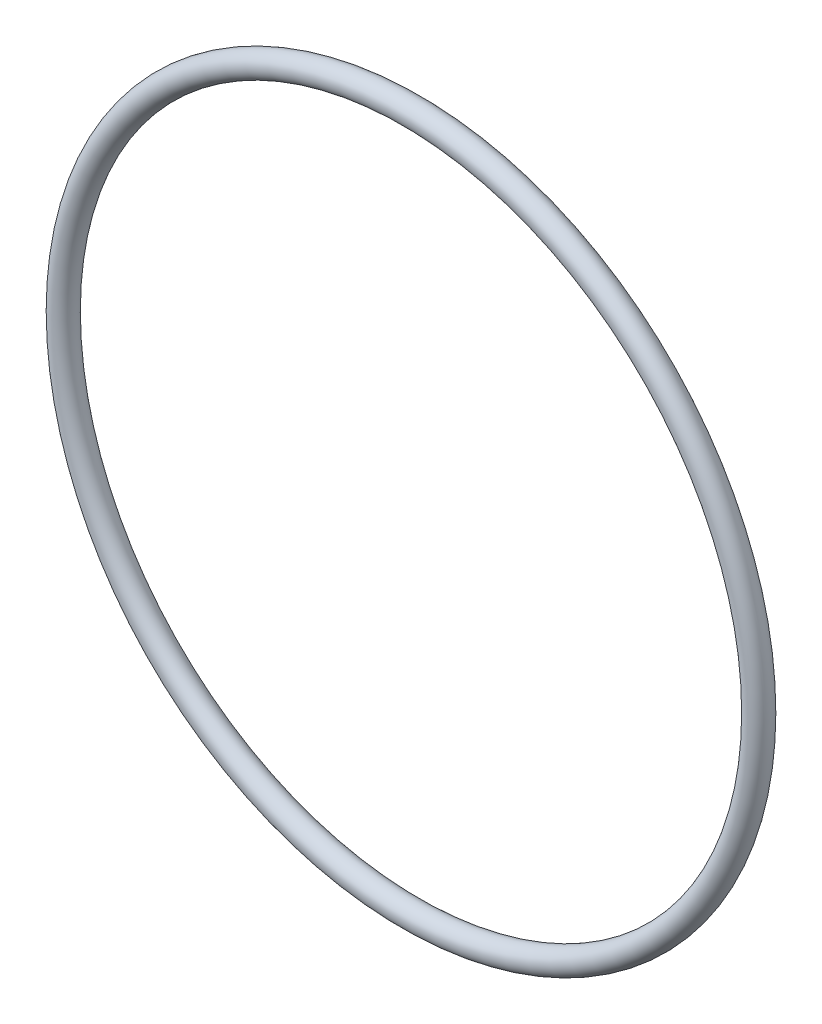
ISO-10303-21;
HEADER;
FILE_DESCRIPTION(('STEP AP214'),'2;1');
FILE_NAME('part.step','',(''),(''),'','','');
FILE_SCHEMA(('AUTOMOTIVE_DESIGN { 1 0 10303 214 1 1 1 1 }'));
ENDSEC;
DATA;
#1=APPLICATION_CONTEXT('core data for automotive mechanical design processes');
#2=APPLICATION_PROTOCOL_DEFINITION('international standard','automotive_design',2000,#1);
#3=PRODUCT_CONTEXT('',#1,'mechanical');
#4=PRODUCT('Part','Part','',(#3));
#5=PRODUCT_RELATED_PRODUCT_CATEGORY('part','',(#4));
#6=PRODUCT_DEFINITION_FORMATION('','',#4);
#7=PRODUCT_DEFINITION_CONTEXT('part definition',#1,'design');
#8=PRODUCT_DEFINITION('design','',#6,#7);
#9=PRODUCT_DEFINITION_SHAPE('','',#8);
#10=(LENGTH_UNIT() NAMED_UNIT(*) SI_UNIT(.MILLI.,.METRE.));
#11=(NAMED_UNIT(*) PLANE_ANGLE_UNIT() SI_UNIT($,.RADIAN.));
#12=(NAMED_UNIT(*) SI_UNIT($,.STERADIAN.) SOLID_ANGLE_UNIT());
#13=UNCERTAINTY_MEASURE_WITH_UNIT(LENGTH_MEASURE(1.E-05),#10,'distance_accuracy_value','');
#14=(GEOMETRIC_REPRESENTATION_CONTEXT(3) GLOBAL_UNCERTAINTY_ASSIGNED_CONTEXT((#13)) GLOBAL_UNIT_ASSIGNED_CONTEXT((#10,
#11,#12)) REPRESENTATION_CONTEXT('',''));
#15=CARTESIAN_POINT('',(0.,0.,0.));
#16=DIRECTION('',(0.,0.,1.));
#17=DIRECTION('',(1.,0.,0.));
#18=AXIS2_PLACEMENT_3D('',#15,#16,#17);
#19=CARTESIAN_POINT('',(0.,0.,0.));
#20=DIRECTION('',(0.,0.,1.));
#21=DIRECTION('',(1.,0.,0.));
#22=AXIS2_PLACEMENT_3D('',#19,#20,#21);
#23=TOROIDAL_SURFACE('',#22,50.7746,1.76530000000001);
#24=CARTESIAN_POINT('',(52.5399,0.,0.));
#25=VERTEX_POINT('',#24);
#26=VERTEX_LOOP('',#25);
#27=FACE_BOUND('',#26,.T.);
#28=ADVANCED_FACE('F27',(#27),#23,.T.);
#29=CLOSED_SHELL('',(#28));
#30=MANIFOLD_SOLID_BREP('B2',#29);
#31=ADVANCED_BREP_SHAPE_REPRESENTATION('',(#18,#30),#14);
#32=SHAPE_DEFINITION_REPRESENTATION(#9,#31);
ENDSEC;
END-ISO-10303-21;
